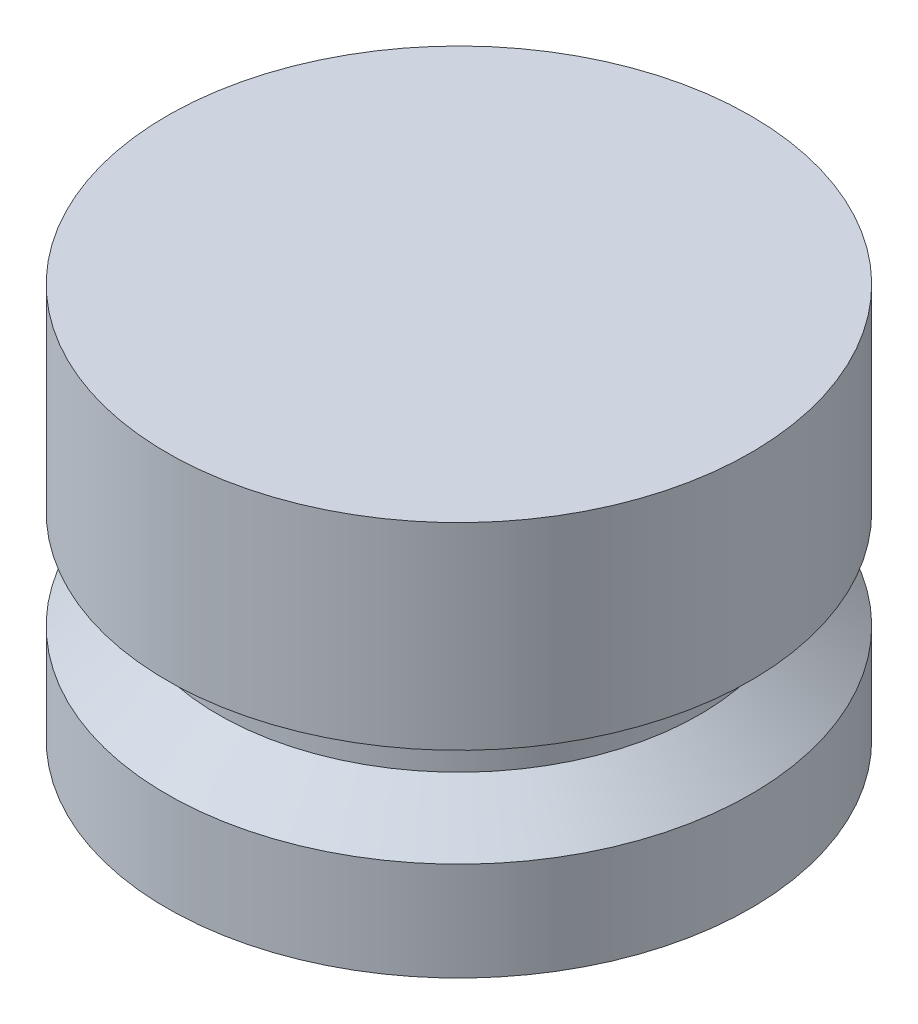
ISO-10303-21;
HEADER;
FILE_DESCRIPTION(('STEP AP214'),'2;1');
FILE_NAME('part.step','',(''),(''),'','','');
FILE_SCHEMA(('AUTOMOTIVE_DESIGN { 1 0 10303 214 1 1 1 1 }'));
ENDSEC;
DATA;
#1=APPLICATION_CONTEXT('core data for automotive mechanical design processes');
#2=APPLICATION_PROTOCOL_DEFINITION('international standard','automotive_design',2000,#1);
#3=PRODUCT_CONTEXT('',#1,'mechanical');
#4=PRODUCT('Part','Part','',(#3));
#5=PRODUCT_RELATED_PRODUCT_CATEGORY('part','',(#4));
#6=PRODUCT_DEFINITION_FORMATION('','',#4);
#7=PRODUCT_DEFINITION_CONTEXT('part definition',#1,'design');
#8=PRODUCT_DEFINITION('design','',#6,#7);
#9=PRODUCT_DEFINITION_SHAPE('','',#8);
#10=(LENGTH_UNIT() NAMED_UNIT(*) SI_UNIT(.MILLI.,.METRE.));
#11=(NAMED_UNIT(*) PLANE_ANGLE_UNIT() SI_UNIT($,.RADIAN.));
#12=(NAMED_UNIT(*) SI_UNIT($,.STERADIAN.) SOLID_ANGLE_UNIT());
#13=UNCERTAINTY_MEASURE_WITH_UNIT(LENGTH_MEASURE(1.E-05),#10,'distance_accuracy_value','');
#14=(GEOMETRIC_REPRESENTATION_CONTEXT(3) GLOBAL_UNCERTAINTY_ASSIGNED_CONTEXT((#13)) GLOBAL_UNIT_ASSIGNED_CONTEXT((#10,
#11,#12)) REPRESENTATION_CONTEXT('',''));
#15=CARTESIAN_POINT('',(0.,0.,0.));
#16=DIRECTION('',(0.,0.,1.));
#17=DIRECTION('',(1.,0.,0.));
#18=AXIS2_PLACEMENT_3D('',#15,#16,#17);
#19=CARTESIAN_POINT('',(0.,0.,0.));
#20=DIRECTION('',(0.,1.,0.));
#21=DIRECTION('',(0.,0.,1.));
#22=AXIS2_PLACEMENT_3D('',#19,#20,#21);
#23=PLANE('',#22);
#24=CARTESIAN_POINT('',(0.,0.,0.));
#25=DIRECTION('',(0.,-1.,0.));
#26=DIRECTION('',(0.,0.,-1.));
#27=AXIS2_PLACEMENT_3D('',#24,#25,#26);
#28=CIRCLE('',#27,9.398);
#29=CARTESIAN_POINT('',(0.,0.,-9.398));
#30=VERTEX_POINT('',#29);
#31=EDGE_CURVE('E10',#30,#30,#28,.T.);
#32=ORIENTED_EDGE('',*,*,#31,.T.);
#33=EDGE_LOOP('',(#32));
#34=FACE_BOUND('',#33,.T.);
#35=ADVANCED_FACE('F31',(#34),#23,.F.);
#36=CARTESIAN_POINT('',(0.,0.,0.));
#37=DIRECTION('',(0.,-1.,0.));
#38=DIRECTION('',(0.,0.,-1.));
#39=AXIS2_PLACEMENT_3D('',#36,#37,#38);
#40=CYLINDRICAL_SURFACE('',#39,9.398);
#41=ORIENTED_EDGE('',*,*,#31,.F.);
#42=EDGE_LOOP('',(#41));
#43=FACE_BOUND('',#42,.T.);
#44=CARTESIAN_POINT('',(0.,3.175,0.));
#45=DIRECTION('',(0.,-1.,0.));
#46=DIRECTION('',(0.,0.,-1.));
#47=AXIS2_PLACEMENT_3D('',#44,#45,#46);
#48=CIRCLE('',#47,9.398);
#49=CARTESIAN_POINT('',(0.,3.175,-9.398));
#50=VERTEX_POINT('',#49);
#51=EDGE_CURVE('E37',#50,#50,#48,.T.);
#52=ORIENTED_EDGE('',*,*,#51,.T.);
#53=EDGE_LOOP('',(#52));
#54=FACE_BOUND('',#53,.T.);
#55=ADVANCED_FACE('F69',(#43,#54),#40,.T.);
#56=CARTESIAN_POINT('',(0.,4.572,0.));
#57=DIRECTION('',(0.,-1.,0.));
#58=DIRECTION('',(0.,0.,-1.));
#59=AXIS2_PLACEMENT_3D('',#56,#57,#58);
#60=CONICAL_SURFACE('',#59,7.747,0.86853939528589);
#61=ORIENTED_EDGE('',*,*,#51,.F.);
#62=EDGE_LOOP('',(#61));
#63=FACE_BOUND('',#62,.T.);
#64=CARTESIAN_POINT('',(0.,4.572,0.));
#65=DIRECTION('',(0.,-1.,0.));
#66=DIRECTION('',(0.,0.,-1.));
#67=AXIS2_PLACEMENT_3D('',#64,#65,#66);
#68=CIRCLE('',#67,7.747);
#69=CARTESIAN_POINT('',(0.,4.572,-7.747));
#70=VERTEX_POINT('',#69);
#71=EDGE_CURVE('E41',#70,#70,#68,.T.);
#72=ORIENTED_EDGE('',*,*,#71,.T.);
#73=EDGE_LOOP('',(#72));
#74=FACE_BOUND('',#73,.T.);
#75=ADVANCED_FACE('F73',(#63,#74),#60,.T.);
#76=CARTESIAN_POINT('',(0.,0.,0.));
#77=DIRECTION('',(0.,-1.,0.));
#78=DIRECTION('',(0.,0.,-1.));
#79=AXIS2_PLACEMENT_3D('',#76,#77,#78);
#80=CYLINDRICAL_SURFACE('',#79,7.747);
#81=ORIENTED_EDGE('',*,*,#71,.F.);
#82=EDGE_LOOP('',(#81));
#83=FACE_BOUND('',#82,.T.);
#84=CARTESIAN_POINT('',(0.,6.35,0.));
#85=DIRECTION('',(0.,-1.,0.));
#86=DIRECTION('',(0.,0.,-1.));
#87=AXIS2_PLACEMENT_3D('',#84,#85,#86);
#88=CIRCLE('',#87,7.747);
#89=CARTESIAN_POINT('',(0.,6.35,-7.747));
#90=VERTEX_POINT('',#89);
#91=EDGE_CURVE('E45',#90,#90,#88,.T.);
#92=ORIENTED_EDGE('',*,*,#91,.T.);
#93=EDGE_LOOP('',(#92));
#94=FACE_BOUND('',#93,.T.);
#95=ADVANCED_FACE('F78',(#83,#94),#80,.T.);
#96=CARTESIAN_POINT('',(-7.747,6.35,0.));
#97=DIRECTION('',(0.,1.,0.));
#98=DIRECTION('',(0.,0.,1.));
#99=AXIS2_PLACEMENT_3D('',#96,#97,#98);
#100=PLANE('',#99);
#101=ORIENTED_EDGE('',*,*,#91,.F.);
#102=EDGE_LOOP('',(#101));
#103=FACE_BOUND('',#102,.T.);
#104=CARTESIAN_POINT('',(0.,6.35,0.));
#105=DIRECTION('',(0.,-1.,0.));
#106=DIRECTION('',(0.,0.,-1.));
#107=AXIS2_PLACEMENT_3D('',#104,#105,#106);
#108=CIRCLE('',#107,9.398);
#109=CARTESIAN_POINT('',(0.,6.35,-9.398));
#110=VERTEX_POINT('',#109);
#111=EDGE_CURVE('E50',#110,#110,#108,.T.);
#112=ORIENTED_EDGE('',*,*,#111,.T.);
#113=EDGE_LOOP('',(#112));
#114=FACE_BOUND('',#113,.T.);
#115=ADVANCED_FACE('F65',(#103,#114),#100,.F.);
#116=CARTESIAN_POINT('',(0.,0.,0.));
#117=DIRECTION('',(0.,-1.,0.));
#118=DIRECTION('',(0.,0.,-1.));
#119=AXIS2_PLACEMENT_3D('',#116,#117,#118);
#120=CYLINDRICAL_SURFACE('',#119,9.398);
#121=ORIENTED_EDGE('',*,*,#111,.F.);
#122=EDGE_LOOP('',(#121));
#123=FACE_BOUND('',#122,.T.);
#124=CARTESIAN_POINT('',(0.,12.7,0.));
#125=DIRECTION('',(0.,-1.,0.));
#126=DIRECTION('',(0.,0.,-1.));
#127=AXIS2_PLACEMENT_3D('',#124,#125,#126);
#128=CIRCLE('',#127,9.398);
#129=CARTESIAN_POINT('',(0.,12.7,-9.398));
#130=VERTEX_POINT('',#129);
#131=EDGE_CURVE('E53',#130,#130,#128,.T.);
#132=ORIENTED_EDGE('',*,*,#131,.T.);
#133=EDGE_LOOP('',(#132));
#134=FACE_BOUND('',#133,.T.);
#135=ADVANCED_FACE('F57',(#123,#134),#120,.T.);
#136=CARTESIAN_POINT('',(-9.398,12.7,0.));
#137=DIRECTION('',(0.,-1.,0.));
#138=DIRECTION('',(0.,0.,-1.));
#139=AXIS2_PLACEMENT_3D('',#136,#137,#138);
#140=PLANE('',#139);
#141=ORIENTED_EDGE('',*,*,#131,.F.);
#142=EDGE_LOOP('',(#141));
#143=FACE_BOUND('',#142,.T.);
#144=ADVANCED_FACE('F59',(#143),#140,.F.);
#145=CLOSED_SHELL('',(#35,#55,#75,#95,#115,#135,#144));
#146=MANIFOLD_SOLID_BREP('B2',#145);
#147=ADVANCED_BREP_SHAPE_REPRESENTATION('',(#18,#146),#14);
#148=SHAPE_DEFINITION_REPRESENTATION(#9,#147);
ENDSEC;
END-ISO-10303-21;
